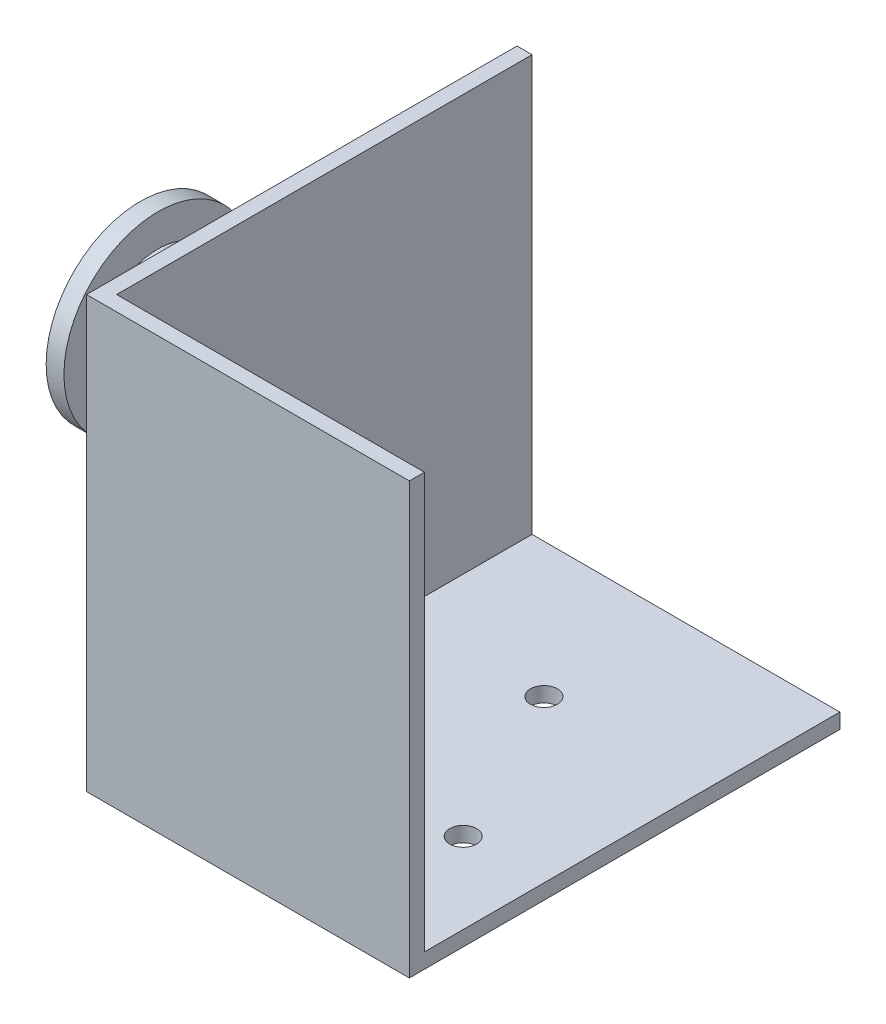
ISO-10303-21;
HEADER;
FILE_DESCRIPTION(('STEP AP214'),'2;1');
FILE_NAME('part.step','',(''),(''),'','','');
FILE_SCHEMA(('AUTOMOTIVE_DESIGN { 1 0 10303 214 1 1 1 1 }'));
ENDSEC;
DATA;
#1=APPLICATION_CONTEXT('core data for automotive mechanical design processes');
#2=APPLICATION_PROTOCOL_DEFINITION('international standard','automotive_design',2000,#1);
#3=PRODUCT_CONTEXT('',#1,'mechanical');
#4=PRODUCT('Part','Part','',(#3));
#5=PRODUCT_RELATED_PRODUCT_CATEGORY('part','',(#4));
#6=PRODUCT_DEFINITION_FORMATION('','',#4);
#7=PRODUCT_DEFINITION_CONTEXT('part definition',#1,'design');
#8=PRODUCT_DEFINITION('design','',#6,#7);
#9=PRODUCT_DEFINITION_SHAPE('','',#8);
#10=(LENGTH_UNIT() NAMED_UNIT(*) SI_UNIT(.MILLI.,.METRE.));
#11=(NAMED_UNIT(*) PLANE_ANGLE_UNIT() SI_UNIT($,.RADIAN.));
#12=(NAMED_UNIT(*) SI_UNIT($,.STERADIAN.) SOLID_ANGLE_UNIT());
#13=UNCERTAINTY_MEASURE_WITH_UNIT(LENGTH_MEASURE(1.E-05),#10,'distance_accuracy_value','');
#14=(GEOMETRIC_REPRESENTATION_CONTEXT(3) GLOBAL_UNCERTAINTY_ASSIGNED_CONTEXT((#13)) GLOBAL_UNIT_ASSIGNED_CONTEXT((#10,
#11,#12)) REPRESENTATION_CONTEXT('',''));
#15=CARTESIAN_POINT('',(0.,0.,0.));
#16=DIRECTION('',(0.,0.,1.));
#17=DIRECTION('',(1.,0.,0.));
#18=AXIS2_PLACEMENT_3D('',#15,#16,#17);
#19=CARTESIAN_POINT('',(-34.29,1.27,0.));
#20=DIRECTION('',(1.,0.,0.));
#21=DIRECTION('',(0.,0.,-1.));
#22=AXIS2_PLACEMENT_3D('',#19,#20,#21);
#23=CYLINDRICAL_SURFACE('',#22,3.81);
#24=CARTESIAN_POINT('',(-15.24,1.27,0.));
#25=DIRECTION('',(-1.,0.,0.));
#26=DIRECTION('',(0.,0.,1.));
#27=AXIS2_PLACEMENT_3D('',#24,#25,#26);
#28=CIRCLE('',#27,3.81);
#29=CARTESIAN_POINT('',(-15.24,1.27,3.81));
#30=VERTEX_POINT('',#29);
#31=EDGE_CURVE('E173',#30,#30,#28,.T.);
#32=ORIENTED_EDGE('',*,*,#31,.T.);
#33=EDGE_LOOP('',(#32));
#34=FACE_BOUND('',#33,.T.);
#35=CARTESIAN_POINT('',(-20.1422,1.27,0.));
#36=DIRECTION('',(-1.,0.,0.));
#37=DIRECTION('',(0.,0.,1.));
#38=AXIS2_PLACEMENT_3D('',#35,#36,#37);
#39=CIRCLE('',#38,3.81);
#40=CARTESIAN_POINT('',(-20.1422,1.27,3.81));
#41=VERTEX_POINT('',#40);
#42=EDGE_CURVE('E174',#41,#41,#39,.T.);
#43=ORIENTED_EDGE('',*,*,#42,.F.);
#44=EDGE_LOOP('',(#43));
#45=FACE_BOUND('',#44,.T.);
#46=ADVANCED_FACE('F45',(#34,#45),#23,.T.);
#47=CARTESIAN_POINT('',(-15.24,20.32,-20.32));
#48=DIRECTION('',(1.,0.,0.));
#49=DIRECTION('',(0.,0.,-1.));
#50=AXIS2_PLACEMENT_3D('',#47,#48,#49);
#51=PLANE('',#50);
#52=ORIENTED_EDGE('',*,*,#31,.F.);
#53=EDGE_LOOP('',(#52));
#54=FACE_BOUND('',#53,.T.);
#55=DIRECTION('',(0.,0.,1.));
#56=VECTOR('',#55,1.);
#57=CARTESIAN_POINT('',(-15.24,-20.32,-20.32));
#58=LINE('',#57,#56);
#59=CARTESIAN_POINT('',(-15.24,-20.32,-20.32));
#60=VERTEX_POINT('',#59);
#61=CARTESIAN_POINT('',(-15.24,-20.32,20.32));
#62=VERTEX_POINT('',#61);
#63=EDGE_CURVE('E148',#60,#62,#58,.T.);
#64=ORIENTED_EDGE('',*,*,#63,.T.);
#65=DIRECTION('',(0.,-1.,0.));
#66=VECTOR('',#65,1.);
#67=CARTESIAN_POINT('',(-15.24,20.32,20.32));
#68=LINE('',#67,#66);
#69=CARTESIAN_POINT('',(-15.24,20.32,20.32));
#70=VERTEX_POINT('',#69);
#71=EDGE_CURVE('E170',#70,#62,#68,.T.);
#72=ORIENTED_EDGE('',*,*,#71,.F.);
#73=DIRECTION('',(0.,0.,1.));
#74=VECTOR('',#73,1.);
#75=CARTESIAN_POINT('',(-15.24,20.32,-20.32));
#76=LINE('',#75,#74);
#77=CARTESIAN_POINT('',(-15.24,20.32,-20.32));
#78=VERTEX_POINT('',#77);
#79=EDGE_CURVE('E144',#78,#70,#76,.T.);
#80=ORIENTED_EDGE('',*,*,#79,.F.);
#81=DIRECTION('',(0.,-1.,0.));
#82=VECTOR('',#81,1.);
#83=CARTESIAN_POINT('',(-15.24,20.32,-20.32));
#84=LINE('',#83,#82);
#85=EDGE_CURVE('E142',#78,#60,#84,.T.);
#86=ORIENTED_EDGE('',*,*,#85,.T.);
#87=EDGE_LOOP('',(#64,#72,#80,#86));
#88=FACE_BOUND('',#87,.T.);
#89=ADVANCED_FACE('F197',(#54,#88),#51,.F.);
#90=CARTESIAN_POINT('',(-15.24,20.32,20.32));
#91=DIRECTION('',(0.,0.,-1.));
#92=DIRECTION('',(-1.,0.,0.));
#93=AXIS2_PLACEMENT_3D('',#90,#91,#92);
#94=PLANE('',#93);
#95=DIRECTION('',(1.,0.,0.));
#96=VECTOR('',#95,1.);
#97=CARTESIAN_POINT('',(-15.24,-20.32,20.32));
#98=LINE('',#97,#96);
#99=CARTESIAN_POINT('',(15.24,-20.32,20.32));
#100=VERTEX_POINT('',#99);
#101=EDGE_CURVE('E152',#62,#100,#98,.T.);
#102=ORIENTED_EDGE('',*,*,#101,.T.);
#103=DIRECTION('',(0.,-1.,0.));
#104=VECTOR('',#103,1.);
#105=CARTESIAN_POINT('',(15.24,20.32,20.32));
#106=LINE('',#105,#104);
#107=CARTESIAN_POINT('',(15.24,20.32,20.32));
#108=VERTEX_POINT('',#107);
#109=EDGE_CURVE('E167',#108,#100,#106,.T.);
#110=ORIENTED_EDGE('',*,*,#109,.F.);
#111=DIRECTION('',(1.,0.,0.));
#112=VECTOR('',#111,1.);
#113=CARTESIAN_POINT('',(-15.24,20.32,20.32));
#114=LINE('',#113,#112);
#115=EDGE_CURVE('E95',#70,#108,#114,.T.);
#116=ORIENTED_EDGE('',*,*,#115,.F.);
#117=ORIENTED_EDGE('',*,*,#71,.T.);
#118=EDGE_LOOP('',(#102,#110,#116,#117));
#119=FACE_BOUND('',#118,.T.);
#120=ADVANCED_FACE('F202',(#119),#94,.F.);
#121=CARTESIAN_POINT('',(15.24,20.32,-20.32));
#122=DIRECTION('',(-1.,0.,0.));
#123=DIRECTION('',(0.,0.,1.));
#124=AXIS2_PLACEMENT_3D('',#121,#122,#123);
#125=PLANE('',#124);
#126=DIRECTION('',(0.,-1.,0.));
#127=VECTOR('',#126,1.);
#128=CARTESIAN_POINT('',(15.24,20.32,-20.32));
#129=LINE('',#128,#127);
#130=CARTESIAN_POINT('',(15.24,-18.8976,-20.32));
#131=VERTEX_POINT('',#130);
#132=CARTESIAN_POINT('',(15.24,-20.32,-20.32));
#133=VERTEX_POINT('',#132);
#134=EDGE_CURVE('E164',#131,#133,#129,.T.);
#135=ORIENTED_EDGE('',*,*,#134,.F.);
#136=DIRECTION('',(0.,0.,-1.));
#137=VECTOR('',#136,1.);
#138=CARTESIAN_POINT('',(15.24,-18.8976,18.8976));
#139=LINE('',#138,#137);
#140=CARTESIAN_POINT('',(15.24,-18.8976,18.8976));
#141=VERTEX_POINT('',#140);
#142=EDGE_CURVE('E126',#141,#131,#139,.T.);
#143=ORIENTED_EDGE('',*,*,#142,.F.);
#144=DIRECTION('',(0.,-1.,0.));
#145=VECTOR('',#144,1.);
#146=CARTESIAN_POINT('',(15.24,20.32,18.8976));
#147=LINE('',#146,#145);
#148=CARTESIAN_POINT('',(15.24,20.32,18.8976));
#149=VERTEX_POINT('',#148);
#150=EDGE_CURVE('E119',#149,#141,#147,.T.);
#151=ORIENTED_EDGE('',*,*,#150,.F.);
#152=DIRECTION('',(0.,0.,-1.));
#153=VECTOR('',#152,1.);
#154=CARTESIAN_POINT('',(15.24,20.32,-20.32));
#155=LINE('',#154,#153);
#156=EDGE_CURVE('E133',#108,#149,#155,.T.);
#157=ORIENTED_EDGE('',*,*,#156,.F.);
#158=ORIENTED_EDGE('',*,*,#109,.T.);
#159=DIRECTION('',(0.,0.,-1.));
#160=VECTOR('',#159,1.);
#161=CARTESIAN_POINT('',(15.24,-20.32,-20.32));
#162=LINE('',#161,#160);
#163=EDGE_CURVE('E156',#100,#133,#162,.T.);
#164=ORIENTED_EDGE('',*,*,#163,.T.);
#165=EDGE_LOOP('',(#135,#143,#151,#157,#158,#164));
#166=FACE_BOUND('',#165,.T.);
#167=ADVANCED_FACE('F131',(#166),#125,.F.);
#168=CARTESIAN_POINT('',(-15.24,20.32,-20.32));
#169=DIRECTION('',(0.,0.,1.));
#170=DIRECTION('',(1.,0.,0.));
#171=AXIS2_PLACEMENT_3D('',#168,#169,#170);
#172=PLANE('',#171);
#173=DIRECTION('',(0.,-1.,0.));
#174=VECTOR('',#173,1.);
#175=CARTESIAN_POINT('',(-13.8176,20.32,-20.32));
#176=LINE('',#175,#174);
#177=CARTESIAN_POINT('',(-13.8176,20.32,-20.32));
#178=VERTEX_POINT('',#177);
#179=CARTESIAN_POINT('',(-13.8176,-18.8976,-20.32));
#180=VERTEX_POINT('',#179);
#181=EDGE_CURVE('E61',#178,#180,#176,.T.);
#182=ORIENTED_EDGE('',*,*,#181,.T.);
#183=DIRECTION('',(1.,0.,0.));
#184=VECTOR('',#183,1.);
#185=CARTESIAN_POINT('',(-70.7020618037231,-18.8976,-20.32));
#186=LINE('',#185,#184);
#187=EDGE_CURVE('E253',#180,#131,#186,.T.);
#188=ORIENTED_EDGE('',*,*,#187,.T.);
#189=ORIENTED_EDGE('',*,*,#134,.T.);
#190=DIRECTION('',(-1.,0.,0.));
#191=VECTOR('',#190,1.);
#192=CARTESIAN_POINT('',(-15.24,-20.32,-20.32));
#193=LINE('',#192,#191);
#194=EDGE_CURVE('E89',#133,#60,#193,.T.);
#195=ORIENTED_EDGE('',*,*,#194,.T.);
#196=ORIENTED_EDGE('',*,*,#85,.F.);
#197=DIRECTION('',(-1.,0.,0.));
#198=VECTOR('',#197,1.);
#199=CARTESIAN_POINT('',(-15.24,20.32,-20.32));
#200=LINE('',#199,#198);
#201=EDGE_CURVE('E69',#178,#78,#200,.T.);
#202=ORIENTED_EDGE('',*,*,#201,.F.);
#203=EDGE_LOOP('',(#182,#188,#189,#195,#196,#202));
#204=FACE_BOUND('',#203,.T.);
#205=ADVANCED_FACE('F234',(#204),#172,.F.);
#206=CARTESIAN_POINT('',(0.,20.32,0.));
#207=DIRECTION('',(0.,1.,0.));
#208=DIRECTION('',(0.,0.,1.));
#209=AXIS2_PLACEMENT_3D('',#206,#207,#208);
#210=PLANE('',#209);
#211=DIRECTION('',(1.,0.,0.));
#212=VECTOR('',#211,1.);
#213=CARTESIAN_POINT('',(-70.7020618037231,20.32,18.8976));
#214=LINE('',#213,#212);
#215=CARTESIAN_POINT('',(-13.8176,20.32,18.8976));
#216=VERTEX_POINT('',#215);
#217=EDGE_CURVE('E115',#216,#149,#214,.T.);
#218=ORIENTED_EDGE('',*,*,#217,.F.);
#219=DIRECTION('',(0.,0.,-1.));
#220=VECTOR('',#219,1.);
#221=CARTESIAN_POINT('',(-13.8176,20.32,18.8976));
#222=LINE('',#221,#220);
#223=EDGE_CURVE('E153',#216,#178,#222,.T.);
#224=ORIENTED_EDGE('',*,*,#223,.T.);
#225=ORIENTED_EDGE('',*,*,#201,.T.);
#226=ORIENTED_EDGE('',*,*,#79,.T.);
#227=ORIENTED_EDGE('',*,*,#115,.T.);
#228=ORIENTED_EDGE('',*,*,#156,.T.);
#229=EDGE_LOOP('',(#218,#224,#225,#226,#227,#228));
#230=FACE_BOUND('',#229,.T.);
#231=ADVANCED_FACE('F137',(#230),#210,.T.);
#232=CARTESIAN_POINT('',(0.,-20.32,0.));
#233=DIRECTION('',(0.,1.,0.));
#234=DIRECTION('',(0.,0.,1.));
#235=AXIS2_PLACEMENT_3D('',#232,#233,#234);
#236=PLANE('',#235);
#237=CARTESIAN_POINT('',(-5.08,-20.32,7.62000000000001));
#238=DIRECTION('',(0.,1.,0.));
#239=DIRECTION('',(0.,0.,1.));
#240=AXIS2_PLACEMENT_3D('',#237,#238,#239);
#241=CIRCLE('',#240,1.27);
#242=CARTESIAN_POINT('',(-5.08,-20.32,8.89000000000001));
#243=VERTEX_POINT('',#242);
#244=EDGE_CURVE('E135',#243,#243,#241,.T.);
#245=ORIENTED_EDGE('',*,*,#244,.T.);
#246=EDGE_LOOP('',(#245));
#247=FACE_BOUND('',#246,.T.);
#248=CARTESIAN_POINT('',(7.62,-20.32,7.62000000000001));
#249=DIRECTION('',(0.,1.,0.));
#250=DIRECTION('',(0.,0.,1.));
#251=AXIS2_PLACEMENT_3D('',#248,#249,#250);
#252=CIRCLE('',#251,1.27);
#253=CARTESIAN_POINT('',(7.62,-20.32,8.89000000000001));
#254=VERTEX_POINT('',#253);
#255=EDGE_CURVE('E285',#254,#254,#252,.T.);
#256=ORIENTED_EDGE('',*,*,#255,.T.);
#257=EDGE_LOOP('',(#256));
#258=FACE_BOUND('',#257,.T.);
#259=CARTESIAN_POINT('',(0.,-20.32,-7.62));
#260=DIRECTION('',(0.,1.,0.));
#261=DIRECTION('',(0.,0.,1.));
#262=AXIS2_PLACEMENT_3D('',#259,#260,#261);
#263=CIRCLE('',#262,1.27);
#264=CARTESIAN_POINT('',(0.,-20.32,-6.35));
#265=VERTEX_POINT('',#264);
#266=EDGE_CURVE('E276',#265,#265,#263,.T.);
#267=ORIENTED_EDGE('',*,*,#266,.T.);
#268=EDGE_LOOP('',(#267));
#269=FACE_BOUND('',#268,.T.);
#270=ORIENTED_EDGE('',*,*,#63,.F.);
#271=ORIENTED_EDGE('',*,*,#194,.F.);
#272=ORIENTED_EDGE('',*,*,#163,.F.);
#273=ORIENTED_EDGE('',*,*,#101,.F.);
#274=EDGE_LOOP('',(#270,#271,#272,#273));
#275=FACE_BOUND('',#274,.T.);
#276=ADVANCED_FACE('F228',(#247,#258,#269,#275),#236,.F.);
#277=CARTESIAN_POINT('',(-70.7020618037231,-18.8976,18.8976));
#278=DIRECTION('',(0.,-1.,0.));
#279=DIRECTION('',(0.,0.,-1.));
#280=AXIS2_PLACEMENT_3D('',#277,#278,#279);
#281=PLANE('',#280);
#282=CARTESIAN_POINT('',(-5.08,-18.8976,7.62000000000001));
#283=DIRECTION('',(0.,1.,0.));
#284=DIRECTION('',(0.,0.,1.));
#285=AXIS2_PLACEMENT_3D('',#282,#283,#284);
#286=CIRCLE('',#285,1.27);
#287=CARTESIAN_POINT('',(-5.08,-18.8976,8.89000000000001));
#288=VERTEX_POINT('',#287);
#289=EDGE_CURVE('E289',#288,#288,#286,.T.);
#290=ORIENTED_EDGE('',*,*,#289,.F.);
#291=EDGE_LOOP('',(#290));
#292=FACE_BOUND('',#291,.T.);
#293=CARTESIAN_POINT('',(7.62,-18.8976,7.62000000000001));
#294=DIRECTION('',(0.,1.,0.));
#295=DIRECTION('',(0.,0.,1.));
#296=AXIS2_PLACEMENT_3D('',#293,#294,#295);
#297=CIRCLE('',#296,1.27);
#298=CARTESIAN_POINT('',(7.62,-18.8976,8.89000000000001));
#299=VERTEX_POINT('',#298);
#300=EDGE_CURVE('E281',#299,#299,#297,.T.);
#301=ORIENTED_EDGE('',*,*,#300,.F.);
#302=EDGE_LOOP('',(#301));
#303=FACE_BOUND('',#302,.T.);
#304=CARTESIAN_POINT('',(0.,-18.8976,-7.62));
#305=DIRECTION('',(0.,1.,0.));
#306=DIRECTION('',(0.,0.,1.));
#307=AXIS2_PLACEMENT_3D('',#304,#305,#306);
#308=CIRCLE('',#307,1.27);
#309=CARTESIAN_POINT('',(0.,-18.8976,-6.35));
#310=VERTEX_POINT('',#309);
#311=EDGE_CURVE('E272',#310,#310,#308,.T.);
#312=ORIENTED_EDGE('',*,*,#311,.F.);
#313=EDGE_LOOP('',(#312));
#314=FACE_BOUND('',#313,.T.);
#315=DIRECTION('',(0.,0.,1.));
#316=VECTOR('',#315,1.);
#317=CARTESIAN_POINT('',(-13.8176,-18.8976,18.8976));
#318=LINE('',#317,#316);
#319=CARTESIAN_POINT('',(-13.8176,-18.8976,18.8976));
#320=VERTEX_POINT('',#319);
#321=EDGE_CURVE('E255',#180,#320,#318,.T.);
#322=ORIENTED_EDGE('',*,*,#321,.T.);
#323=DIRECTION('',(1.,0.,0.));
#324=VECTOR('',#323,1.);
#325=CARTESIAN_POINT('',(-70.7020618037231,-18.8976,18.8976));
#326=LINE('',#325,#324);
#327=EDGE_CURVE('E125',#320,#141,#326,.T.);
#328=ORIENTED_EDGE('',*,*,#327,.T.);
#329=ORIENTED_EDGE('',*,*,#142,.T.);
#330=ORIENTED_EDGE('',*,*,#187,.F.);
#331=EDGE_LOOP('',(#322,#328,#329,#330));
#332=FACE_BOUND('',#331,.T.);
#333=ADVANCED_FACE('F225',(#292,#303,#314,#332),#281,.F.);
#334=CARTESIAN_POINT('',(-70.7020618037231,20.32,18.8976));
#335=DIRECTION('',(0.,0.,1.));
#336=DIRECTION('',(1.,0.,0.));
#337=AXIS2_PLACEMENT_3D('',#334,#335,#336);
#338=PLANE('',#337);
#339=DIRECTION('',(0.,1.,0.));
#340=VECTOR('',#339,1.);
#341=CARTESIAN_POINT('',(-13.8176,20.32,18.8976));
#342=LINE('',#341,#340);
#343=EDGE_CURVE('E122',#320,#216,#342,.T.);
#344=ORIENTED_EDGE('',*,*,#343,.T.);
#345=ORIENTED_EDGE('',*,*,#217,.T.);
#346=ORIENTED_EDGE('',*,*,#150,.T.);
#347=ORIENTED_EDGE('',*,*,#327,.F.);
#348=EDGE_LOOP('',(#344,#345,#346,#347));
#349=FACE_BOUND('',#348,.T.);
#350=ADVANCED_FACE('F117',(#349),#338,.F.);
#351=CARTESIAN_POINT('',(-13.8176,20.32,-20.32));
#352=DIRECTION('',(1.,0.,0.));
#353=DIRECTION('',(0.,0.,-1.));
#354=AXIS2_PLACEMENT_3D('',#351,#352,#353);
#355=PLANE('',#354);
#356=ORIENTED_EDGE('',*,*,#181,.F.);
#357=ORIENTED_EDGE('',*,*,#223,.F.);
#358=ORIENTED_EDGE('',*,*,#343,.F.);
#359=ORIENTED_EDGE('',*,*,#321,.F.);
#360=EDGE_LOOP('',(#356,#357,#358,#359));
#361=FACE_BOUND('',#360,.T.);
#362=ADVANCED_FACE('F221',(#361),#355,.T.);
#363=CARTESIAN_POINT('',(0.,-20.32,-7.62));
#364=DIRECTION('',(0.,1.,0.));
#365=DIRECTION('',(0.,0.,1.));
#366=AXIS2_PLACEMENT_3D('',#363,#364,#365);
#367=CYLINDRICAL_SURFACE('',#366,1.27);
#368=ORIENTED_EDGE('',*,*,#266,.F.);
#369=EDGE_LOOP('',(#368));
#370=FACE_BOUND('',#369,.T.);
#371=ORIENTED_EDGE('',*,*,#311,.T.);
#372=EDGE_LOOP('',(#371));
#373=FACE_BOUND('',#372,.T.);
#374=ADVANCED_FACE('F217',(#370,#373),#367,.F.);
#375=CARTESIAN_POINT('',(7.62,-20.32,7.62000000000001));
#376=DIRECTION('',(0.,1.,0.));
#377=DIRECTION('',(0.,0.,1.));
#378=AXIS2_PLACEMENT_3D('',#375,#376,#377);
#379=CYLINDRICAL_SURFACE('',#378,1.27);
#380=ORIENTED_EDGE('',*,*,#255,.F.);
#381=EDGE_LOOP('',(#380));
#382=FACE_BOUND('',#381,.T.);
#383=ORIENTED_EDGE('',*,*,#300,.T.);
#384=EDGE_LOOP('',(#383));
#385=FACE_BOUND('',#384,.T.);
#386=ADVANCED_FACE('F213',(#382,#385),#379,.F.);
#387=CARTESIAN_POINT('',(-5.08,-20.32,7.62000000000001));
#388=DIRECTION('',(0.,1.,0.));
#389=DIRECTION('',(0.,0.,1.));
#390=AXIS2_PLACEMENT_3D('',#387,#388,#389);
#391=CYLINDRICAL_SURFACE('',#390,1.27);
#392=ORIENTED_EDGE('',*,*,#244,.F.);
#393=EDGE_LOOP('',(#392));
#394=FACE_BOUND('',#393,.T.);
#395=ORIENTED_EDGE('',*,*,#289,.T.);
#396=EDGE_LOOP('',(#395));
#397=FACE_BOUND('',#396,.T.);
#398=ADVANCED_FACE('F209',(#394,#397),#391,.F.);
#399=CARTESIAN_POINT('',(-30.48,5.08,0.));
#400=DIRECTION('',(1.,0.,0.));
#401=DIRECTION('',(0.,0.,-1.));
#402=AXIS2_PLACEMENT_3D('',#399,#400,#401);
#403=PLANE('',#402);
#404=CARTESIAN_POINT('',(-30.48,1.27,0.));
#405=DIRECTION('',(1.,0.,0.));
#406=DIRECTION('',(0.,0.,-1.));
#407=AXIS2_PLACEMENT_3D('',#404,#405,#406);
#408=CIRCLE('',#407,3.81);
#409=CARTESIAN_POINT('',(-30.48,1.27,-3.81));
#410=VERTEX_POINT('',#409);
#411=EDGE_CURVE('E178',#410,#410,#408,.T.);
#412=ORIENTED_EDGE('',*,*,#411,.T.);
#413=EDGE_LOOP('',(#412));
#414=FACE_BOUND('',#413,.T.);
#415=CARTESIAN_POINT('',(-30.48,1.27,0.));
#416=DIRECTION('',(-1.,0.,0.));
#417=DIRECTION('',(0.,0.,1.));
#418=AXIS2_PLACEMENT_3D('',#415,#416,#417);
#419=CIRCLE('',#418,8.89);
#420=CARTESIAN_POINT('',(-30.48,1.27,8.89));
#421=VERTEX_POINT('',#420);
#422=EDGE_CURVE('E277',#421,#421,#419,.T.);
#423=ORIENTED_EDGE('',*,*,#422,.T.);
#424=EDGE_LOOP('',(#423));
#425=FACE_BOUND('',#424,.T.);
#426=ADVANCED_FACE('F212',(#414,#425),#403,.F.);
#427=CARTESIAN_POINT('',(-34.29,1.27,0.));
#428=DIRECTION('',(-1.,0.,0.));
#429=DIRECTION('',(0.,0.,1.));
#430=AXIS2_PLACEMENT_3D('',#427,#428,#429);
#431=CYLINDRICAL_SURFACE('',#430,8.89);
#432=ORIENTED_EDGE('',*,*,#422,.F.);
#433=EDGE_LOOP('',(#432));
#434=FACE_BOUND('',#433,.T.);
#435=CARTESIAN_POINT('',(-28.8036,1.27,0.));
#436=DIRECTION('',(-1.,0.,0.));
#437=DIRECTION('',(0.,0.,1.));
#438=AXIS2_PLACEMENT_3D('',#435,#436,#437);
#439=CIRCLE('',#438,8.89);
#440=CARTESIAN_POINT('',(-28.8036,1.27,8.89));
#441=VERTEX_POINT('',#440);
#442=EDGE_CURVE('E301',#441,#441,#439,.T.);
#443=ORIENTED_EDGE('',*,*,#442,.T.);
#444=EDGE_LOOP('',(#443));
#445=FACE_BOUND('',#444,.T.);
#446=ADVANCED_FACE('F347',(#434,#445),#431,.T.);
#447=CARTESIAN_POINT('',(-28.8036,10.16,0.));
#448=DIRECTION('',(-1.,0.,0.));
#449=DIRECTION('',(0.,0.,1.));
#450=AXIS2_PLACEMENT_3D('',#447,#448,#449);
#451=PLANE('',#450);
#452=ORIENTED_EDGE('',*,*,#442,.F.);
#453=EDGE_LOOP('',(#452));
#454=FACE_BOUND('',#453,.T.);
#455=CARTESIAN_POINT('',(-28.8036,1.27,0.));
#456=DIRECTION('',(-1.,0.,0.));
#457=DIRECTION('',(0.,0.,1.));
#458=AXIS2_PLACEMENT_3D('',#455,#456,#457);
#459=CIRCLE('',#458,5.842);
#460=CARTESIAN_POINT('',(-28.8036,1.27,5.842));
#461=VERTEX_POINT('',#460);
#462=EDGE_CURVE('E305',#461,#461,#459,.T.);
#463=ORIENTED_EDGE('',*,*,#462,.T.);
#464=EDGE_LOOP('',(#463));
#465=FACE_BOUND('',#464,.T.);
#466=ADVANCED_FACE('F343',(#454,#465),#451,.F.);
#467=CARTESIAN_POINT('',(-34.29,1.27,0.));
#468=DIRECTION('',(-1.,0.,0.));
#469=DIRECTION('',(0.,0.,1.));
#470=AXIS2_PLACEMENT_3D('',#467,#468,#469);
#471=CYLINDRICAL_SURFACE('',#470,5.842);
#472=ORIENTED_EDGE('',*,*,#462,.F.);
#473=EDGE_LOOP('',(#472));
#474=FACE_BOUND('',#473,.T.);
#475=CARTESIAN_POINT('',(-21.8186,1.27,0.));
#476=DIRECTION('',(-1.,0.,0.));
#477=DIRECTION('',(0.,0.,1.));
#478=AXIS2_PLACEMENT_3D('',#475,#476,#477);
#479=CIRCLE('',#478,5.842);
#480=CARTESIAN_POINT('',(-21.8186,1.27,5.842));
#481=VERTEX_POINT('',#480);
#482=EDGE_CURVE('E309',#481,#481,#479,.T.);
#483=ORIENTED_EDGE('',*,*,#482,.T.);
#484=EDGE_LOOP('',(#483));
#485=FACE_BOUND('',#484,.T.);
#486=ADVANCED_FACE('F339',(#474,#485),#471,.T.);
#487=CARTESIAN_POINT('',(-21.8186,7.11199999999999,0.));
#488=DIRECTION('',(1.,0.,0.));
#489=DIRECTION('',(0.,0.,-1.));
#490=AXIS2_PLACEMENT_3D('',#487,#488,#489);
#491=PLANE('',#490);
#492=ORIENTED_EDGE('',*,*,#482,.F.);
#493=EDGE_LOOP('',(#492));
#494=FACE_BOUND('',#493,.T.);
#495=CARTESIAN_POINT('',(-21.8186,1.27,0.));
#496=DIRECTION('',(-1.,0.,0.));
#497=DIRECTION('',(0.,0.,1.));
#498=AXIS2_PLACEMENT_3D('',#495,#496,#497);
#499=CIRCLE('',#498,8.89);
#500=CARTESIAN_POINT('',(-21.8186,1.27,8.89));
#501=VERTEX_POINT('',#500);
#502=EDGE_CURVE('E313',#501,#501,#499,.T.);
#503=ORIENTED_EDGE('',*,*,#502,.T.);
#504=EDGE_LOOP('',(#503));
#505=FACE_BOUND('',#504,.T.);
#506=ADVANCED_FACE('F333',(#494,#505),#491,.F.);
#507=CARTESIAN_POINT('',(-34.29,1.27,0.));
#508=DIRECTION('',(-1.,0.,0.));
#509=DIRECTION('',(0.,0.,1.));
#510=AXIS2_PLACEMENT_3D('',#507,#508,#509);
#511=CYLINDRICAL_SURFACE('',#510,8.89);
#512=ORIENTED_EDGE('',*,*,#502,.F.);
#513=EDGE_LOOP('',(#512));
#514=FACE_BOUND('',#513,.T.);
#515=CARTESIAN_POINT('',(-20.1422,1.27,0.));
#516=DIRECTION('',(-1.,0.,0.));
#517=DIRECTION('',(0.,0.,1.));
#518=AXIS2_PLACEMENT_3D('',#515,#516,#517);
#519=CIRCLE('',#518,8.89);
#520=CARTESIAN_POINT('',(-20.1422,1.27,8.89));
#521=VERTEX_POINT('',#520);
#522=EDGE_CURVE('E317',#521,#521,#519,.T.);
#523=ORIENTED_EDGE('',*,*,#522,.T.);
#524=EDGE_LOOP('',(#523));
#525=FACE_BOUND('',#524,.T.);
#526=ADVANCED_FACE('F322',(#514,#525),#511,.T.);
#527=CARTESIAN_POINT('',(-20.1422,10.16,0.));
#528=DIRECTION('',(-1.,0.,0.));
#529=DIRECTION('',(0.,0.,1.));
#530=AXIS2_PLACEMENT_3D('',#527,#528,#529);
#531=PLANE('',#530);
#532=ORIENTED_EDGE('',*,*,#522,.F.);
#533=EDGE_LOOP('',(#532));
#534=FACE_BOUND('',#533,.T.);
#535=ORIENTED_EDGE('',*,*,#42,.T.);
#536=EDGE_LOOP('',(#535));
#537=FACE_BOUND('',#536,.T.);
#538=ADVANCED_FACE('F324',(#534,#537),#531,.F.);
#539=CARTESIAN_POINT('',(-34.29,1.27,0.));
#540=DIRECTION('',(-1.,0.,0.));
#541=DIRECTION('',(0.,0.,1.));
#542=AXIS2_PLACEMENT_3D('',#539,#540,#541);
#543=PLANE('',#542);
#544=CARTESIAN_POINT('',(-34.29,1.27,0.));
#545=DIRECTION('',(-1.,0.,0.));
#546=DIRECTION('',(0.,0.,1.));
#547=AXIS2_PLACEMENT_3D('',#544,#545,#546);
#548=CIRCLE('',#547,1.27);
#549=CARTESIAN_POINT('',(-34.29,1.27,1.27));
#550=VERTEX_POINT('',#549);
#551=EDGE_CURVE('E54',#550,#550,#548,.T.);
#552=ORIENTED_EDGE('',*,*,#551,.T.);
#553=EDGE_LOOP('',(#552));
#554=FACE_BOUND('',#553,.T.);
#555=ADVANCED_FACE('F185',(#554),#543,.T.);
#556=CARTESIAN_POINT('',(-31.75,1.27,0.));
#557=DIRECTION('',(-1.,0.,0.));
#558=DIRECTION('',(0.,0.,1.));
#559=AXIS2_PLACEMENT_3D('',#556,#557,#558);
#560=CIRCLE('',#559,3.81);
#561=CARTESIAN_POINT('',(-31.75,1.27,3.81));
#562=VERTEX_POINT('',#561);
#563=EDGE_CURVE('E12',#562,#562,#560,.F.);
#564=ORIENTED_EDGE('',*,*,#563,.T.);
#565=EDGE_LOOP('',(#564));
#566=FACE_BOUND('',#565,.T.);
#567=ORIENTED_EDGE('',*,*,#411,.F.);
#568=EDGE_LOOP('',(#567));
#569=FACE_BOUND('',#568,.T.);
#570=ADVANCED_FACE('F188',(#566,#569),#23,.T.);
#571=CARTESIAN_POINT('',(-31.75,1.27,0.));
#572=DIRECTION('',(-1.,0.,0.));
#573=DIRECTION('',(0.,0.,1.));
#574=AXIS2_PLACEMENT_3D('',#571,#572,#573);
#575=DEGENERATE_TOROIDAL_SURFACE('',#574,1.27,2.54,.T.);
#576=ORIENTED_EDGE('',*,*,#563,.F.);
#577=EDGE_LOOP('',(#576));
#578=FACE_BOUND('',#577,.T.);
#579=ORIENTED_EDGE('',*,*,#551,.F.);
#580=EDGE_LOOP('',(#579));
#581=FACE_BOUND('',#580,.T.);
#582=ADVANCED_FACE('F47',(#578,#581),#575,.T.);
#583=CLOSED_SHELL('',(#46,#89,#120,#167,#205,#231,#276,#333,#350,#362,#374,#386,#398,#426,#446,
#466,#486,#506,#526,#538,#555,#570,#582));
#584=MANIFOLD_SOLID_BREP('B2',#583);
#585=ADVANCED_BREP_SHAPE_REPRESENTATION('',(#18,#584),#14);
#586=SHAPE_DEFINITION_REPRESENTATION(#9,#585);
ENDSEC;
END-ISO-10303-21;
